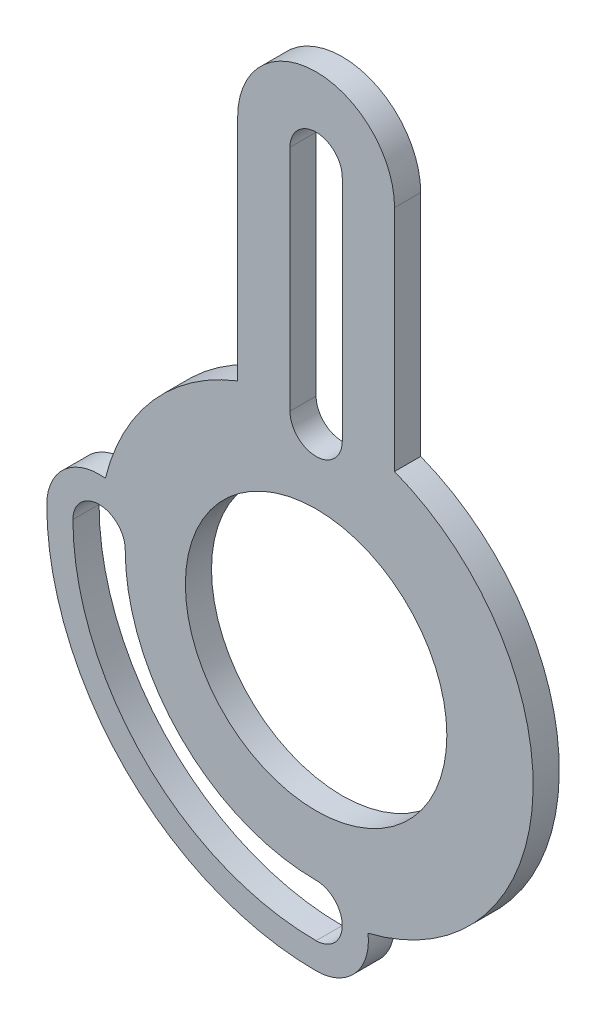
ISO-10303-21;
HEADER;
FILE_DESCRIPTION(('STEP AP214'),'2;1');
FILE_NAME('part.step','',(''),(''),'','','');
FILE_SCHEMA(('AUTOMOTIVE_DESIGN { 1 0 10303 214 1 1 1 1 }'));
ENDSEC;
DATA;
#1=APPLICATION_CONTEXT('core data for automotive mechanical design processes');
#2=APPLICATION_PROTOCOL_DEFINITION('international standard','automotive_design',2000,#1);
#3=PRODUCT_CONTEXT('',#1,'mechanical');
#4=PRODUCT('Part','Part','',(#3));
#5=PRODUCT_RELATED_PRODUCT_CATEGORY('part','',(#4));
#6=PRODUCT_DEFINITION_FORMATION('','',#4);
#7=PRODUCT_DEFINITION_CONTEXT('part definition',#1,'design');
#8=PRODUCT_DEFINITION('design','',#6,#7);
#9=PRODUCT_DEFINITION_SHAPE('','',#8);
#10=(LENGTH_UNIT() NAMED_UNIT(*) SI_UNIT(.MILLI.,.METRE.));
#11=(NAMED_UNIT(*) PLANE_ANGLE_UNIT() SI_UNIT($,.RADIAN.));
#12=(NAMED_UNIT(*) SI_UNIT($,.STERADIAN.) SOLID_ANGLE_UNIT());
#13=UNCERTAINTY_MEASURE_WITH_UNIT(LENGTH_MEASURE(1.E-05),#10,'distance_accuracy_value','');
#14=(GEOMETRIC_REPRESENTATION_CONTEXT(3) GLOBAL_UNCERTAINTY_ASSIGNED_CONTEXT((#13)) GLOBAL_UNIT_ASSIGNED_CONTEXT((#10,
#11,#12)) REPRESENTATION_CONTEXT('',''));
#15=CARTESIAN_POINT('',(0.,0.,0.));
#16=DIRECTION('',(0.,0.,1.));
#17=DIRECTION('',(1.,0.,0.));
#18=AXIS2_PLACEMENT_3D('',#15,#16,#17);
#19=CARTESIAN_POINT('',(0.,82.39,5.));
#20=DIRECTION('',(0.,0.,-1.));
#21=DIRECTION('',(-1.,0.,0.));
#22=AXIS2_PLACEMENT_3D('',#19,#20,#21);
#23=PLANE('',#22);
#24=CARTESIAN_POINT('',(0.,38.69,5.));
#25=DIRECTION('',(0.,0.,1.));
#26=DIRECTION('',(1.,0.,0.));
#27=AXIS2_PLACEMENT_3D('',#24,#25,#26);
#28=CIRCLE('',#27,5.);
#29=CARTESIAN_POINT('',(-5.,38.69,5.));
#30=VERTEX_POINT('',#29);
#31=CARTESIAN_POINT('',(5.,38.69,5.));
#32=VERTEX_POINT('',#31);
#33=EDGE_CURVE('E185',#30,#32,#28,.T.);
#34=ORIENTED_EDGE('',*,*,#33,.F.);
#35=DIRECTION('',(0.,-1.,0.));
#36=VECTOR('',#35,1.);
#37=CARTESIAN_POINT('',(-5.,38.69,5.));
#38=LINE('',#37,#36);
#39=CARTESIAN_POINT('',(-5.,82.39,5.));
#40=VERTEX_POINT('',#39);
#41=EDGE_CURVE('E193',#40,#30,#38,.T.);
#42=ORIENTED_EDGE('',*,*,#41,.F.);
#43=CARTESIAN_POINT('',(0.,82.39,5.));
#44=DIRECTION('',(0.,0.,1.));
#45=DIRECTION('',(1.,0.,0.));
#46=AXIS2_PLACEMENT_3D('',#43,#44,#45);
#47=CIRCLE('',#46,5.);
#48=CARTESIAN_POINT('',(5.,82.39,5.));
#49=VERTEX_POINT('',#48);
#50=EDGE_CURVE('E190',#49,#40,#47,.T.);
#51=ORIENTED_EDGE('',*,*,#50,.F.);
#52=DIRECTION('',(0.,1.,0.));
#53=VECTOR('',#52,1.);
#54=CARTESIAN_POINT('',(5.,38.69,5.));
#55=LINE('',#54,#53);
#56=EDGE_CURVE('E187',#32,#49,#55,.T.);
#57=ORIENTED_EDGE('',*,*,#56,.F.);
#58=EDGE_LOOP('',(#34,#42,#51,#57));
#59=FACE_BOUND('',#58,.T.);
#60=CARTESIAN_POINT('',(0.,82.39,5.));
#61=DIRECTION('',(0.,0.,1.));
#62=DIRECTION('',(-1.,0.,0.));
#63=AXIS2_PLACEMENT_3D('',#60,#61,#62);
#64=CIRCLE('',#63,15.);
#65=CARTESIAN_POINT('',(15.,82.39,5.));
#66=VERTEX_POINT('',#65);
#67=CARTESIAN_POINT('',(-15.,82.39,5.));
#68=VERTEX_POINT('',#67);
#69=EDGE_CURVE('E222',#66,#68,#64,.T.);
#70=ORIENTED_EDGE('',*,*,#69,.T.);
#71=DIRECTION('',(0.,-1.,0.));
#72=VECTOR('',#71,1.);
#73=CARTESIAN_POINT('',(-15.,82.39,5.));
#74=LINE('',#73,#72);
#75=CARTESIAN_POINT('',(-15.,38.6943148278917,5.));
#76=VERTEX_POINT('',#75);
#77=EDGE_CURVE('E225',#68,#76,#74,.T.);
#78=ORIENTED_EDGE('',*,*,#77,.T.);
#79=CARTESIAN_POINT('',(0.,0.,5.));
#80=DIRECTION('',(0.,0.,1.));
#81=DIRECTION('',(1.,0.,0.));
#82=AXIS2_PLACEMENT_3D('',#79,#80,#81);
#83=CIRCLE('',#82,41.5);
#84=CARTESIAN_POINT('',(-40.2951807228916,9.92715520728411,5.));
#85=VERTEX_POINT('',#84);
#86=EDGE_CURVE('E228',#76,#85,#83,.T.);
#87=ORIENTED_EDGE('',*,*,#86,.T.);
#88=CARTESIAN_POINT('',(-41.5,0.,5.));
#89=DIRECTION('',(0.,0.,1.));
#90=DIRECTION('',(1.,0.,0.));
#91=AXIS2_PLACEMENT_3D('',#88,#89,#90);
#92=CIRCLE('',#91,9.99999999999999);
#93=CARTESIAN_POINT('',(-51.5,0.,5.));
#94=VERTEX_POINT('',#93);
#95=EDGE_CURVE('E230',#85,#94,#92,.T.);
#96=ORIENTED_EDGE('',*,*,#95,.T.);
#97=CARTESIAN_POINT('',(0.,0.,5.));
#98=DIRECTION('',(0.,0.,1.));
#99=DIRECTION('',(1.,0.,0.));
#100=AXIS2_PLACEMENT_3D('',#97,#98,#99);
#101=CIRCLE('',#100,51.5);
#102=CARTESIAN_POINT('',(0.,-51.5,5.));
#103=VERTEX_POINT('',#102);
#104=EDGE_CURVE('E232',#94,#103,#101,.T.);
#105=ORIENTED_EDGE('',*,*,#104,.T.);
#106=CARTESIAN_POINT('',(0.,-41.5,5.));
#107=DIRECTION('',(0.,0.,1.));
#108=DIRECTION('',(1.,0.,0.));
#109=AXIS2_PLACEMENT_3D('',#106,#107,#108);
#110=CIRCLE('',#109,9.99999999999999);
#111=CARTESIAN_POINT('',(9.9271552072841,-40.2951807228916,5.));
#112=VERTEX_POINT('',#111);
#113=EDGE_CURVE('E234',#103,#112,#110,.T.);
#114=ORIENTED_EDGE('',*,*,#113,.T.);
#115=CARTESIAN_POINT('',(0.,0.,5.));
#116=DIRECTION('',(0.,0.,1.));
#117=DIRECTION('',(-1.,0.,0.));
#118=AXIS2_PLACEMENT_3D('',#115,#116,#117);
#119=CIRCLE('',#118,41.5);
#120=CARTESIAN_POINT('',(15.,38.6943148278917,5.));
#121=VERTEX_POINT('',#120);
#122=EDGE_CURVE('E236',#112,#121,#119,.T.);
#123=ORIENTED_EDGE('',*,*,#122,.T.);
#124=DIRECTION('',(0.,1.,0.));
#125=VECTOR('',#124,1.);
#126=CARTESIAN_POINT('',(15.,82.39,5.));
#127=LINE('',#126,#125);
#128=EDGE_CURVE('E238',#121,#66,#127,.T.);
#129=ORIENTED_EDGE('',*,*,#128,.T.);
#130=EDGE_LOOP('',(#70,#78,#87,#96,#105,#114,#123,#129));
#131=FACE_BOUND('',#130,.T.);
#132=CARTESIAN_POINT('',(0.,0.,5.));
#133=DIRECTION('',(0.,0.,1.));
#134=DIRECTION('',(1.,0.,0.));
#135=AXIS2_PLACEMENT_3D('',#132,#133,#134);
#136=CIRCLE('',#135,25.);
#137=CARTESIAN_POINT('',(25.,0.,5.));
#138=VERTEX_POINT('',#137);
#139=EDGE_CURVE('E216',#138,#138,#136,.T.);
#140=ORIENTED_EDGE('',*,*,#139,.F.);
#141=EDGE_LOOP('',(#140));
#142=FACE_BOUND('',#141,.T.);
#143=CARTESIAN_POINT('',(-41.5,0.,5.));
#144=DIRECTION('',(0.,0.,1.));
#145=DIRECTION('',(1.,0.,0.));
#146=AXIS2_PLACEMENT_3D('',#143,#144,#145);
#147=CIRCLE('',#146,5.);
#148=CARTESIAN_POINT('',(-36.5,0.,5.));
#149=VERTEX_POINT('',#148);
#150=CARTESIAN_POINT('',(-46.5,0.,5.));
#151=VERTEX_POINT('',#150);
#152=EDGE_CURVE('E149',#149,#151,#147,.T.);
#153=ORIENTED_EDGE('',*,*,#152,.F.);
#154=CARTESIAN_POINT('',(0.,0.,5.));
#155=DIRECTION('',(0.,0.,-1.));
#156=DIRECTION('',(1.,0.,0.));
#157=AXIS2_PLACEMENT_3D('',#154,#155,#156);
#158=CIRCLE('',#157,36.5);
#159=CARTESIAN_POINT('',(0.,-36.5,5.));
#160=VERTEX_POINT('',#159);
#161=EDGE_CURVE('E171',#160,#149,#158,.T.);
#162=ORIENTED_EDGE('',*,*,#161,.F.);
#163=CARTESIAN_POINT('',(0.,-41.5,5.));
#164=DIRECTION('',(0.,0.,1.));
#165=DIRECTION('',(1.,0.,0.));
#166=AXIS2_PLACEMENT_3D('',#163,#164,#165);
#167=CIRCLE('',#166,5.);
#168=CARTESIAN_POINT('',(0.,-46.5,5.));
#169=VERTEX_POINT('',#168);
#170=EDGE_CURVE('E169',#169,#160,#167,.T.);
#171=ORIENTED_EDGE('',*,*,#170,.F.);
#172=CARTESIAN_POINT('',(0.,0.,5.));
#173=DIRECTION('',(0.,0.,1.));
#174=DIRECTION('',(1.,0.,0.));
#175=AXIS2_PLACEMENT_3D('',#172,#173,#174);
#176=CIRCLE('',#175,46.5);
#177=EDGE_CURVE('E157',#151,#169,#176,.T.);
#178=ORIENTED_EDGE('',*,*,#177,.F.);
#179=EDGE_LOOP('',(#153,#162,#171,#178));
#180=FACE_BOUND('',#179,.T.);
#181=ADVANCED_FACE('F36',(#59,#131,#142,#180),#23,.F.);
#182=CARTESIAN_POINT('',(0.,82.39,0.));
#183=DIRECTION('',(0.,0.,-1.));
#184=DIRECTION('',(-1.,0.,0.));
#185=AXIS2_PLACEMENT_3D('',#182,#183,#184);
#186=PLANE('',#185);
#187=CARTESIAN_POINT('',(0.,82.39,0.));
#188=DIRECTION('',(0.,0.,1.));
#189=DIRECTION('',(-1.,0.,0.));
#190=AXIS2_PLACEMENT_3D('',#187,#188,#189);
#191=CIRCLE('',#190,15.);
#192=CARTESIAN_POINT('',(15.,82.39,0.));
#193=VERTEX_POINT('',#192);
#194=CARTESIAN_POINT('',(-15.,82.39,0.));
#195=VERTEX_POINT('',#194);
#196=EDGE_CURVE('E219',#193,#195,#191,.T.);
#197=ORIENTED_EDGE('',*,*,#196,.F.);
#198=DIRECTION('',(0.,1.,0.));
#199=VECTOR('',#198,1.);
#200=CARTESIAN_POINT('',(15.,82.39,0.));
#201=LINE('',#200,#199);
#202=CARTESIAN_POINT('',(15.,38.6943148278917,0.));
#203=VERTEX_POINT('',#202);
#204=EDGE_CURVE('E226',#203,#193,#201,.T.);
#205=ORIENTED_EDGE('',*,*,#204,.F.);
#206=CARTESIAN_POINT('',(0.,0.,0.));
#207=DIRECTION('',(0.,0.,1.));
#208=DIRECTION('',(-1.,0.,0.));
#209=AXIS2_PLACEMENT_3D('',#206,#207,#208);
#210=CIRCLE('',#209,41.5);
#211=CARTESIAN_POINT('',(9.9271552072841,-40.2951807228916,0.));
#212=VERTEX_POINT('',#211);
#213=EDGE_CURVE('E253',#212,#203,#210,.T.);
#214=ORIENTED_EDGE('',*,*,#213,.F.);
#215=CARTESIAN_POINT('',(0.,-41.5,0.));
#216=DIRECTION('',(0.,0.,1.));
#217=DIRECTION('',(1.,0.,0.));
#218=AXIS2_PLACEMENT_3D('',#215,#216,#217);
#219=CIRCLE('',#218,9.99999999999999);
#220=CARTESIAN_POINT('',(0.,-51.5,0.));
#221=VERTEX_POINT('',#220);
#222=EDGE_CURVE('E251',#221,#212,#219,.T.);
#223=ORIENTED_EDGE('',*,*,#222,.F.);
#224=CARTESIAN_POINT('',(0.,0.,0.));
#225=DIRECTION('',(0.,0.,1.));
#226=DIRECTION('',(1.,0.,0.));
#227=AXIS2_PLACEMENT_3D('',#224,#225,#226);
#228=CIRCLE('',#227,51.5);
#229=CARTESIAN_POINT('',(-51.5,0.,0.));
#230=VERTEX_POINT('',#229);
#231=EDGE_CURVE('E249',#230,#221,#228,.T.);
#232=ORIENTED_EDGE('',*,*,#231,.F.);
#233=CARTESIAN_POINT('',(-41.5,0.,0.));
#234=DIRECTION('',(0.,0.,1.));
#235=DIRECTION('',(1.,0.,0.));
#236=AXIS2_PLACEMENT_3D('',#233,#234,#235);
#237=CIRCLE('',#236,9.99999999999999);
#238=CARTESIAN_POINT('',(-40.2951807228916,9.92715520728411,0.));
#239=VERTEX_POINT('',#238);
#240=EDGE_CURVE('E247',#239,#230,#237,.T.);
#241=ORIENTED_EDGE('',*,*,#240,.F.);
#242=CARTESIAN_POINT('',(0.,0.,0.));
#243=DIRECTION('',(0.,0.,1.));
#244=DIRECTION('',(1.,0.,0.));
#245=AXIS2_PLACEMENT_3D('',#242,#243,#244);
#246=CIRCLE('',#245,41.5);
#247=CARTESIAN_POINT('',(-15.,38.6943148278917,0.));
#248=VERTEX_POINT('',#247);
#249=EDGE_CURVE('E245',#248,#239,#246,.T.);
#250=ORIENTED_EDGE('',*,*,#249,.F.);
#251=DIRECTION('',(0.,-1.,0.));
#252=VECTOR('',#251,1.);
#253=CARTESIAN_POINT('',(-15.,82.39,0.));
#254=LINE('',#253,#252);
#255=EDGE_CURVE('E243',#195,#248,#254,.T.);
#256=ORIENTED_EDGE('',*,*,#255,.F.);
#257=EDGE_LOOP('',(#197,#205,#214,#223,#232,#241,#250,#256));
#258=FACE_BOUND('',#257,.T.);
#259=CARTESIAN_POINT('',(0.,0.,0.));
#260=DIRECTION('',(0.,0.,1.));
#261=DIRECTION('',(1.,0.,0.));
#262=AXIS2_PLACEMENT_3D('',#259,#260,#261);
#263=CIRCLE('',#262,25.);
#264=CARTESIAN_POINT('',(25.,0.,0.));
#265=VERTEX_POINT('',#264);
#266=EDGE_CURVE('E215',#265,#265,#263,.T.);
#267=ORIENTED_EDGE('',*,*,#266,.T.);
#268=EDGE_LOOP('',(#267));
#269=FACE_BOUND('',#268,.T.);
#270=DIRECTION('',(0.,-1.,0.));
#271=VECTOR('',#270,1.);
#272=CARTESIAN_POINT('',(-5.,38.69,0.));
#273=LINE('',#272,#271);
#274=CARTESIAN_POINT('',(-5.,82.39,0.));
#275=VERTEX_POINT('',#274);
#276=CARTESIAN_POINT('',(-5.,38.69,0.));
#277=VERTEX_POINT('',#276);
#278=EDGE_CURVE('E188',#275,#277,#273,.T.);
#279=ORIENTED_EDGE('',*,*,#278,.T.);
#280=CARTESIAN_POINT('',(0.,38.69,0.));
#281=DIRECTION('',(0.,0.,1.));
#282=DIRECTION('',(1.,0.,0.));
#283=AXIS2_PLACEMENT_3D('',#280,#281,#282);
#284=CIRCLE('',#283,5.);
#285=CARTESIAN_POINT('',(5.,38.69,0.));
#286=VERTEX_POINT('',#285);
#287=EDGE_CURVE('E165',#277,#286,#284,.T.);
#288=ORIENTED_EDGE('',*,*,#287,.T.);
#289=DIRECTION('',(0.,1.,0.));
#290=VECTOR('',#289,1.);
#291=CARTESIAN_POINT('',(5.,38.69,0.));
#292=LINE('',#291,#290);
#293=CARTESIAN_POINT('',(5.,82.39,0.));
#294=VERTEX_POINT('',#293);
#295=EDGE_CURVE('E198',#286,#294,#292,.T.);
#296=ORIENTED_EDGE('',*,*,#295,.T.);
#297=CARTESIAN_POINT('',(0.,82.39,0.));
#298=DIRECTION('',(0.,0.,1.));
#299=DIRECTION('',(1.,0.,0.));
#300=AXIS2_PLACEMENT_3D('',#297,#298,#299);
#301=CIRCLE('',#300,5.);
#302=EDGE_CURVE('E201',#294,#275,#301,.T.);
#303=ORIENTED_EDGE('',*,*,#302,.T.);
#304=EDGE_LOOP('',(#279,#288,#296,#303));
#305=FACE_BOUND('',#304,.T.);
#306=CARTESIAN_POINT('',(0.,0.,0.));
#307=DIRECTION('',(0.,0.,-1.));
#308=DIRECTION('',(1.,0.,0.));
#309=AXIS2_PLACEMENT_3D('',#306,#307,#308);
#310=CIRCLE('',#309,36.5);
#311=CARTESIAN_POINT('',(0.,-36.5,0.));
#312=VERTEX_POINT('',#311);
#313=CARTESIAN_POINT('',(-36.5,0.,0.));
#314=VERTEX_POINT('',#313);
#315=EDGE_CURVE('E158',#312,#314,#310,.T.);
#316=ORIENTED_EDGE('',*,*,#315,.T.);
#317=CARTESIAN_POINT('',(-41.5,0.,0.));
#318=DIRECTION('',(0.,0.,1.));
#319=DIRECTION('',(1.,0.,0.));
#320=AXIS2_PLACEMENT_3D('',#317,#318,#319);
#321=CIRCLE('',#320,5.);
#322=CARTESIAN_POINT('',(-46.5,0.,0.));
#323=VERTEX_POINT('',#322);
#324=EDGE_CURVE('E59',#314,#323,#321,.T.);
#325=ORIENTED_EDGE('',*,*,#324,.T.);
#326=CARTESIAN_POINT('',(0.,0.,0.));
#327=DIRECTION('',(0.,0.,1.));
#328=DIRECTION('',(1.,0.,0.));
#329=AXIS2_PLACEMENT_3D('',#326,#327,#328);
#330=CIRCLE('',#329,46.5);
#331=CARTESIAN_POINT('',(0.,-46.5,0.));
#332=VERTEX_POINT('',#331);
#333=EDGE_CURVE('E164',#323,#332,#330,.T.);
#334=ORIENTED_EDGE('',*,*,#333,.T.);
#335=CARTESIAN_POINT('',(0.,-41.5,0.));
#336=DIRECTION('',(0.,0.,1.));
#337=DIRECTION('',(1.,0.,0.));
#338=AXIS2_PLACEMENT_3D('',#335,#336,#337);
#339=CIRCLE('',#338,5.);
#340=EDGE_CURVE('E177',#332,#312,#339,.T.);
#341=ORIENTED_EDGE('',*,*,#340,.T.);
#342=EDGE_LOOP('',(#316,#325,#334,#341));
#343=FACE_BOUND('',#342,.T.);
#344=ADVANCED_FACE('F283',(#258,#269,#305,#343),#186,.T.);
#345=CARTESIAN_POINT('',(0.,82.39,5.));
#346=DIRECTION('',(0.,0.,-1.));
#347=DIRECTION('',(-1.,0.,0.));
#348=AXIS2_PLACEMENT_3D('',#345,#346,#347);
#349=CYLINDRICAL_SURFACE('',#348,15.);
#350=ORIENTED_EDGE('',*,*,#196,.T.);
#351=DIRECTION('',(0.,0.,-1.));
#352=VECTOR('',#351,1.);
#353=CARTESIAN_POINT('',(-15.,82.39,5.));
#354=LINE('',#353,#352);
#355=EDGE_CURVE('E11',#68,#195,#354,.T.);
#356=ORIENTED_EDGE('',*,*,#355,.F.);
#357=ORIENTED_EDGE('',*,*,#69,.F.);
#358=DIRECTION('',(0.,0.,-1.));
#359=VECTOR('',#358,1.);
#360=CARTESIAN_POINT('',(15.,82.39,5.));
#361=LINE('',#360,#359);
#362=EDGE_CURVE('E240',#66,#193,#361,.T.);
#363=ORIENTED_EDGE('',*,*,#362,.T.);
#364=EDGE_LOOP('',(#350,#356,#357,#363));
#365=FACE_BOUND('',#364,.T.);
#366=ADVANCED_FACE('F38',(#365),#349,.T.);
#367=CARTESIAN_POINT('',(-15.,82.39,5.));
#368=DIRECTION('',(1.,0.,0.));
#369=DIRECTION('',(0.,1.,0.));
#370=AXIS2_PLACEMENT_3D('',#367,#368,#369);
#371=PLANE('',#370);
#372=ORIENTED_EDGE('',*,*,#255,.T.);
#373=DIRECTION('',(0.,0.,-1.));
#374=VECTOR('',#373,1.);
#375=CARTESIAN_POINT('',(-15.,38.6943148278917,5.));
#376=LINE('',#375,#374);
#377=EDGE_CURVE('E44',#76,#248,#376,.T.);
#378=ORIENTED_EDGE('',*,*,#377,.F.);
#379=ORIENTED_EDGE('',*,*,#77,.F.);
#380=ORIENTED_EDGE('',*,*,#355,.T.);
#381=EDGE_LOOP('',(#372,#378,#379,#380));
#382=FACE_BOUND('',#381,.T.);
#383=ADVANCED_FACE('F301',(#382),#371,.F.);
#384=CARTESIAN_POINT('',(0.,0.,5.));
#385=DIRECTION('',(0.,0.,-1.));
#386=DIRECTION('',(-1.,0.,0.));
#387=AXIS2_PLACEMENT_3D('',#384,#385,#386);
#388=CYLINDRICAL_SURFACE('',#387,41.5);
#389=ORIENTED_EDGE('',*,*,#249,.T.);
#390=DIRECTION('',(0.,0.,-1.));
#391=VECTOR('',#390,1.);
#392=CARTESIAN_POINT('',(-40.2951807228916,9.92715520728411,5.));
#393=LINE('',#392,#391);
#394=EDGE_CURVE('E270',#85,#239,#393,.T.);
#395=ORIENTED_EDGE('',*,*,#394,.F.);
#396=ORIENTED_EDGE('',*,*,#86,.F.);
#397=ORIENTED_EDGE('',*,*,#377,.T.);
#398=EDGE_LOOP('',(#389,#395,#396,#397));
#399=FACE_BOUND('',#398,.T.);
#400=ADVANCED_FACE('F277',(#399),#388,.T.);
#401=CARTESIAN_POINT('',(-41.5,0.,5.));
#402=DIRECTION('',(0.,0.,-1.));
#403=DIRECTION('',(-1.,0.,0.));
#404=AXIS2_PLACEMENT_3D('',#401,#402,#403);
#405=CYLINDRICAL_SURFACE('',#404,9.99999999999999);
#406=ORIENTED_EDGE('',*,*,#240,.T.);
#407=DIRECTION('',(0.,0.,-1.));
#408=VECTOR('',#407,1.);
#409=CARTESIAN_POINT('',(-51.5,0.,5.));
#410=LINE('',#409,#408);
#411=EDGE_CURVE('E267',#94,#230,#410,.T.);
#412=ORIENTED_EDGE('',*,*,#411,.F.);
#413=ORIENTED_EDGE('',*,*,#95,.F.);
#414=ORIENTED_EDGE('',*,*,#394,.T.);
#415=EDGE_LOOP('',(#406,#412,#413,#414));
#416=FACE_BOUND('',#415,.T.);
#417=ADVANCED_FACE('F289',(#416),#405,.T.);
#418=CARTESIAN_POINT('',(0.,0.,5.));
#419=DIRECTION('',(0.,0.,-1.));
#420=DIRECTION('',(-1.,0.,0.));
#421=AXIS2_PLACEMENT_3D('',#418,#419,#420);
#422=CYLINDRICAL_SURFACE('',#421,51.5);
#423=ORIENTED_EDGE('',*,*,#231,.T.);
#424=DIRECTION('',(0.,0.,-1.));
#425=VECTOR('',#424,1.);
#426=CARTESIAN_POINT('',(0.,-51.5,5.));
#427=LINE('',#426,#425);
#428=EDGE_CURVE('E264',#103,#221,#427,.T.);
#429=ORIENTED_EDGE('',*,*,#428,.F.);
#430=ORIENTED_EDGE('',*,*,#104,.F.);
#431=ORIENTED_EDGE('',*,*,#411,.T.);
#432=EDGE_LOOP('',(#423,#429,#430,#431));
#433=FACE_BOUND('',#432,.T.);
#434=ADVANCED_FACE('F293',(#433),#422,.T.);
#435=CARTESIAN_POINT('',(0.,-41.5,5.));
#436=DIRECTION('',(0.,0.,-1.));
#437=DIRECTION('',(-1.,0.,0.));
#438=AXIS2_PLACEMENT_3D('',#435,#436,#437);
#439=CYLINDRICAL_SURFACE('',#438,9.99999999999999);
#440=ORIENTED_EDGE('',*,*,#222,.T.);
#441=DIRECTION('',(0.,0.,-1.));
#442=VECTOR('',#441,1.);
#443=CARTESIAN_POINT('',(9.9271552072841,-40.2951807228916,5.));
#444=LINE('',#443,#442);
#445=EDGE_CURVE('E261',#112,#212,#444,.T.);
#446=ORIENTED_EDGE('',*,*,#445,.F.);
#447=ORIENTED_EDGE('',*,*,#113,.F.);
#448=ORIENTED_EDGE('',*,*,#428,.T.);
#449=EDGE_LOOP('',(#440,#446,#447,#448));
#450=FACE_BOUND('',#449,.T.);
#451=ADVANCED_FACE('F314',(#450),#439,.T.);
#452=CARTESIAN_POINT('',(0.,0.,5.));
#453=DIRECTION('',(0.,0.,-1.));
#454=DIRECTION('',(-1.,0.,0.));
#455=AXIS2_PLACEMENT_3D('',#452,#453,#454);
#456=CYLINDRICAL_SURFACE('',#455,41.5);
#457=ORIENTED_EDGE('',*,*,#213,.T.);
#458=DIRECTION('',(0.,0.,-1.));
#459=VECTOR('',#458,1.);
#460=CARTESIAN_POINT('',(15.,38.6943148278917,5.));
#461=LINE('',#460,#459);
#462=EDGE_CURVE('E258',#121,#203,#461,.T.);
#463=ORIENTED_EDGE('',*,*,#462,.F.);
#464=ORIENTED_EDGE('',*,*,#122,.F.);
#465=ORIENTED_EDGE('',*,*,#445,.T.);
#466=EDGE_LOOP('',(#457,#463,#464,#465));
#467=FACE_BOUND('',#466,.T.);
#468=ADVANCED_FACE('F312',(#467),#456,.T.);
#469=CARTESIAN_POINT('',(15.,82.39,5.));
#470=DIRECTION('',(-1.,0.,0.));
#471=DIRECTION('',(0.,-1.,0.));
#472=AXIS2_PLACEMENT_3D('',#469,#470,#471);
#473=PLANE('',#472);
#474=ORIENTED_EDGE('',*,*,#204,.T.);
#475=ORIENTED_EDGE('',*,*,#362,.F.);
#476=ORIENTED_EDGE('',*,*,#128,.F.);
#477=ORIENTED_EDGE('',*,*,#462,.T.);
#478=EDGE_LOOP('',(#474,#475,#476,#477));
#479=FACE_BOUND('',#478,.T.);
#480=ADVANCED_FACE('F307',(#479),#473,.F.);
#481=CARTESIAN_POINT('',(0.,0.,5.));
#482=DIRECTION('',(0.,0.,-1.));
#483=DIRECTION('',(-1.,0.,0.));
#484=AXIS2_PLACEMENT_3D('',#481,#482,#483);
#485=CYLINDRICAL_SURFACE('',#484,25.);
#486=ORIENTED_EDGE('',*,*,#139,.T.);
#487=EDGE_LOOP('',(#486));
#488=FACE_BOUND('',#487,.T.);
#489=ORIENTED_EDGE('',*,*,#266,.F.);
#490=EDGE_LOOP('',(#489));
#491=FACE_BOUND('',#490,.T.);
#492=ADVANCED_FACE('F332',(#488,#491),#485,.F.);
#493=CARTESIAN_POINT('',(0.,38.69,5.));
#494=DIRECTION('',(0.,0.,-1.));
#495=DIRECTION('',(-1.,0.,0.));
#496=AXIS2_PLACEMENT_3D('',#493,#494,#495);
#497=CYLINDRICAL_SURFACE('',#496,5.);
#498=ORIENTED_EDGE('',*,*,#287,.F.);
#499=DIRECTION('',(0.,0.,-1.));
#500=VECTOR('',#499,1.);
#501=CARTESIAN_POINT('',(-5.,38.69,5.));
#502=LINE('',#501,#500);
#503=EDGE_CURVE('E195',#30,#277,#502,.T.);
#504=ORIENTED_EDGE('',*,*,#503,.F.);
#505=ORIENTED_EDGE('',*,*,#33,.T.);
#506=DIRECTION('',(0.,0.,-1.));
#507=VECTOR('',#506,1.);
#508=CARTESIAN_POINT('',(5.,38.69,5.));
#509=LINE('',#508,#507);
#510=EDGE_CURVE('E212',#32,#286,#509,.T.);
#511=ORIENTED_EDGE('',*,*,#510,.T.);
#512=EDGE_LOOP('',(#498,#504,#505,#511));
#513=FACE_BOUND('',#512,.T.);
#514=ADVANCED_FACE('F339',(#513),#497,.F.);
#515=CARTESIAN_POINT('',(5.,38.69,5.));
#516=DIRECTION('',(-1.,0.,0.));
#517=DIRECTION('',(0.,0.,1.));
#518=AXIS2_PLACEMENT_3D('',#515,#516,#517);
#519=PLANE('',#518);
#520=ORIENTED_EDGE('',*,*,#295,.F.);
#521=ORIENTED_EDGE('',*,*,#510,.F.);
#522=ORIENTED_EDGE('',*,*,#56,.T.);
#523=DIRECTION('',(0.,0.,-1.));
#524=VECTOR('',#523,1.);
#525=CARTESIAN_POINT('',(5.,82.39,5.));
#526=LINE('',#525,#524);
#527=EDGE_CURVE('E210',#49,#294,#526,.T.);
#528=ORIENTED_EDGE('',*,*,#527,.T.);
#529=EDGE_LOOP('',(#520,#521,#522,#528));
#530=FACE_BOUND('',#529,.T.);
#531=ADVANCED_FACE('F344',(#530),#519,.T.);
#532=CARTESIAN_POINT('',(0.,82.39,5.));
#533=DIRECTION('',(0.,0.,-1.));
#534=DIRECTION('',(-1.,0.,0.));
#535=AXIS2_PLACEMENT_3D('',#532,#533,#534);
#536=CYLINDRICAL_SURFACE('',#535,5.);
#537=ORIENTED_EDGE('',*,*,#302,.F.);
#538=ORIENTED_EDGE('',*,*,#527,.F.);
#539=ORIENTED_EDGE('',*,*,#50,.T.);
#540=DIRECTION('',(0.,0.,-1.));
#541=VECTOR('',#540,1.);
#542=CARTESIAN_POINT('',(-5.,82.39,5.));
#543=LINE('',#542,#541);
#544=EDGE_CURVE('E208',#40,#275,#543,.T.);
#545=ORIENTED_EDGE('',*,*,#544,.T.);
#546=EDGE_LOOP('',(#537,#538,#539,#545));
#547=FACE_BOUND('',#546,.T.);
#548=ADVANCED_FACE('F370',(#547),#536,.F.);
#549=CARTESIAN_POINT('',(-5.,38.69,5.));
#550=DIRECTION('',(1.,0.,0.));
#551=DIRECTION('',(0.,0.,-1.));
#552=AXIS2_PLACEMENT_3D('',#549,#550,#551);
#553=PLANE('',#552);
#554=ORIENTED_EDGE('',*,*,#278,.F.);
#555=ORIENTED_EDGE('',*,*,#544,.F.);
#556=ORIENTED_EDGE('',*,*,#41,.T.);
#557=ORIENTED_EDGE('',*,*,#503,.T.);
#558=EDGE_LOOP('',(#554,#555,#556,#557));
#559=FACE_BOUND('',#558,.T.);
#560=ADVANCED_FACE('F367',(#559),#553,.T.);
#561=CARTESIAN_POINT('',(-41.5,0.,5.));
#562=DIRECTION('',(0.,0.,-1.));
#563=DIRECTION('',(-1.,0.,0.));
#564=AXIS2_PLACEMENT_3D('',#561,#562,#563);
#565=CYLINDRICAL_SURFACE('',#564,5.);
#566=ORIENTED_EDGE('',*,*,#324,.F.);
#567=DIRECTION('',(0.,0.,-1.));
#568=VECTOR('',#567,1.);
#569=CARTESIAN_POINT('',(-36.5,0.,5.));
#570=LINE('',#569,#568);
#571=EDGE_CURVE('E153',#149,#314,#570,.T.);
#572=ORIENTED_EDGE('',*,*,#571,.F.);
#573=ORIENTED_EDGE('',*,*,#152,.T.);
#574=DIRECTION('',(0.,0.,-1.));
#575=VECTOR('',#574,1.);
#576=CARTESIAN_POINT('',(-46.5,0.,5.));
#577=LINE('',#576,#575);
#578=EDGE_CURVE('E152',#151,#323,#577,.T.);
#579=ORIENTED_EDGE('',*,*,#578,.T.);
#580=EDGE_LOOP('',(#566,#572,#573,#579));
#581=FACE_BOUND('',#580,.T.);
#582=ADVANCED_FACE('F151',(#581),#565,.F.);
#583=CARTESIAN_POINT('',(0.,0.,5.));
#584=DIRECTION('',(0.,0.,-1.));
#585=DIRECTION('',(-1.,0.,0.));
#586=AXIS2_PLACEMENT_3D('',#583,#584,#585);
#587=CYLINDRICAL_SURFACE('',#586,46.5);
#588=ORIENTED_EDGE('',*,*,#333,.F.);
#589=ORIENTED_EDGE('',*,*,#578,.F.);
#590=ORIENTED_EDGE('',*,*,#177,.T.);
#591=DIRECTION('',(0.,0.,-1.));
#592=VECTOR('',#591,1.);
#593=CARTESIAN_POINT('',(0.,-46.5,5.));
#594=LINE('',#593,#592);
#595=EDGE_CURVE('E166',#169,#332,#594,.T.);
#596=ORIENTED_EDGE('',*,*,#595,.T.);
#597=EDGE_LOOP('',(#588,#589,#590,#596));
#598=FACE_BOUND('',#597,.T.);
#599=ADVANCED_FACE('F161',(#598),#587,.F.);
#600=CARTESIAN_POINT('',(0.,-41.5,5.));
#601=DIRECTION('',(0.,0.,-1.));
#602=DIRECTION('',(-1.,0.,0.));
#603=AXIS2_PLACEMENT_3D('',#600,#601,#602);
#604=CYLINDRICAL_SURFACE('',#603,5.);
#605=ORIENTED_EDGE('',*,*,#340,.F.);
#606=ORIENTED_EDGE('',*,*,#595,.F.);
#607=ORIENTED_EDGE('',*,*,#170,.T.);
#608=DIRECTION('',(0.,0.,-1.));
#609=VECTOR('',#608,1.);
#610=CARTESIAN_POINT('',(0.,-36.5,5.));
#611=LINE('',#610,#609);
#612=EDGE_CURVE('E51',#160,#312,#611,.T.);
#613=ORIENTED_EDGE('',*,*,#612,.T.);
#614=EDGE_LOOP('',(#605,#606,#607,#613));
#615=FACE_BOUND('',#614,.T.);
#616=ADVANCED_FACE('F355',(#615),#604,.F.);
#617=CARTESIAN_POINT('',(0.,0.,5.));
#618=DIRECTION('',(0.,0.,-1.));
#619=DIRECTION('',(-1.,0.,0.));
#620=AXIS2_PLACEMENT_3D('',#617,#618,#619);
#621=CYLINDRICAL_SURFACE('',#620,36.5);
#622=ORIENTED_EDGE('',*,*,#315,.F.);
#623=ORIENTED_EDGE('',*,*,#612,.F.);
#624=ORIENTED_EDGE('',*,*,#161,.T.);
#625=ORIENTED_EDGE('',*,*,#571,.T.);
#626=EDGE_LOOP('',(#622,#623,#624,#625));
#627=FACE_BOUND('',#626,.T.);
#628=ADVANCED_FACE('F353',(#627),#621,.T.);
#629=CLOSED_SHELL('',(#181,#344,#366,#383,#400,#417,#434,#451,#468,#480,#492,#514,#531,#548,
#560,#582,#599,#616,#628));
#630=MANIFOLD_SOLID_BREP('B2',#629);
#631=ADVANCED_BREP_SHAPE_REPRESENTATION('',(#18,#630),#14);
#632=SHAPE_DEFINITION_REPRESENTATION(#9,#631);
ENDSEC;
END-ISO-10303-21;
